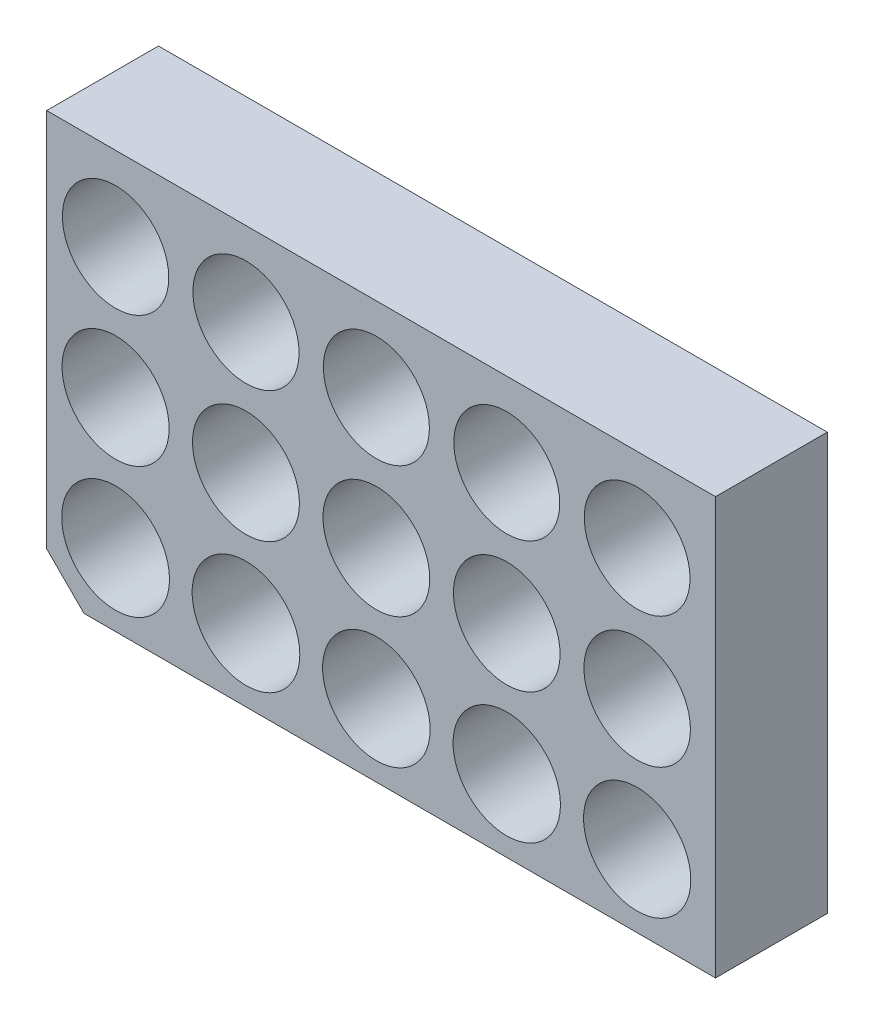
ISO-10303-21;
HEADER;
FILE_DESCRIPTION(('STEP AP214'),'2;1');
FILE_NAME('part.step','',(''),(''),'','','');
FILE_SCHEMA(('AUTOMOTIVE_DESIGN { 1 0 10303 214 1 1 1 1 }'));
ENDSEC;
DATA;
#1=APPLICATION_CONTEXT('core data for automotive mechanical design processes');
#2=APPLICATION_PROTOCOL_DEFINITION('international standard','automotive_design',2000,#1);
#3=PRODUCT_CONTEXT('',#1,'mechanical');
#4=PRODUCT('Part','Part','',(#3));
#5=PRODUCT_RELATED_PRODUCT_CATEGORY('part','',(#4));
#6=PRODUCT_DEFINITION_FORMATION('','',#4);
#7=PRODUCT_DEFINITION_CONTEXT('part definition',#1,'design');
#8=PRODUCT_DEFINITION('design','',#6,#7);
#9=PRODUCT_DEFINITION_SHAPE('','',#8);
#10=(LENGTH_UNIT() NAMED_UNIT(*) SI_UNIT(.MILLI.,.METRE.));
#11=(NAMED_UNIT(*) PLANE_ANGLE_UNIT() SI_UNIT($,.RADIAN.));
#12=(NAMED_UNIT(*) SI_UNIT($,.STERADIAN.) SOLID_ANGLE_UNIT());
#13=UNCERTAINTY_MEASURE_WITH_UNIT(LENGTH_MEASURE(1.E-05),#10,'distance_accuracy_value','');
#14=(GEOMETRIC_REPRESENTATION_CONTEXT(3) GLOBAL_UNCERTAINTY_ASSIGNED_CONTEXT((#13)) GLOBAL_UNIT_ASSIGNED_CONTEXT((#10,
#11,#12)) REPRESENTATION_CONTEXT('',''));
#15=CARTESIAN_POINT('',(0.,0.,0.));
#16=DIRECTION('',(0.,0.,1.));
#17=DIRECTION('',(1.,0.,0.));
#18=AXIS2_PLACEMENT_3D('',#15,#16,#17);
#19=CARTESIAN_POINT('',(0.,0.,7.62));
#20=DIRECTION('',(0.,0.,-1.));
#21=DIRECTION('',(-1.,0.,0.));
#22=AXIS2_PLACEMENT_3D('',#19,#20,#21);
#23=PLANE('',#22);
#24=DIRECTION('',(0.,-1.,0.));
#25=VECTOR('',#24,1.);
#26=CARTESIAN_POINT('',(0.,0.,7.62));
#27=LINE('',#26,#25);
#28=CARTESIAN_POINT('',(0.,28.4186947346982,7.62));
#29=VERTEX_POINT('',#28);
#30=CARTESIAN_POINT('',(0.,2.54000000000001,7.62));
#31=VERTEX_POINT('',#30);
#32=EDGE_CURVE('E97',#29,#31,#27,.T.);
#33=ORIENTED_EDGE('',*,*,#32,.T.);
#34=DIRECTION('',(-0.707106781186546,0.707106781186549,0.));
#35=VECTOR('',#34,1.);
#36=CARTESIAN_POINT('',(2.53999999999999,0.,7.62));
#37=LINE('',#36,#35);
#38=CARTESIAN_POINT('',(2.53999999999999,0.,7.62));
#39=VERTEX_POINT('',#38);
#40=EDGE_CURVE('E11',#31,#39,#37,.F.);
#41=ORIENTED_EDGE('',*,*,#40,.T.);
#42=DIRECTION('',(1.,0.,0.));
#43=VECTOR('',#42,1.);
#44=CARTESIAN_POINT('',(0.,0.,7.62));
#45=LINE('',#44,#43);
#46=CARTESIAN_POINT('',(45.5965586840994,0.,7.62));
#47=VERTEX_POINT('',#46);
#48=EDGE_CURVE('E87',#39,#47,#45,.T.);
#49=ORIENTED_EDGE('',*,*,#48,.T.);
#50=DIRECTION('',(0.,1.,0.));
#51=VECTOR('',#50,1.);
#52=CARTESIAN_POINT('',(45.5965586840994,0.,7.62));
#53=LINE('',#52,#51);
#54=CARTESIAN_POINT('',(45.5965586840994,28.4186947346982,7.62));
#55=VERTEX_POINT('',#54);
#56=EDGE_CURVE('E91',#47,#55,#53,.T.);
#57=ORIENTED_EDGE('',*,*,#56,.T.);
#58=DIRECTION('',(-1.,0.,0.));
#59=VECTOR('',#58,1.);
#60=CARTESIAN_POINT('',(0.,28.4186947346982,7.62));
#61=LINE('',#60,#59);
#62=EDGE_CURVE('E111',#55,#29,#61,.T.);
#63=ORIENTED_EDGE('',*,*,#62,.T.);
#64=EDGE_LOOP('',(#33,#41,#49,#57,#63));
#65=FACE_BOUND('',#64,.T.);
#66=CARTESIAN_POINT('',(4.69472391797769,4.9343876919489,7.62));
#67=DIRECTION('',(0.,0.,1.));
#68=DIRECTION('',(1.,0.,0.));
#69=AXIS2_PLACEMENT_3D('',#66,#67,#68);
#70=CIRCLE('',#69,3.675);
#71=CARTESIAN_POINT('',(8.36972391797769,4.9343876919489,7.62));
#72=VERTEX_POINT('',#71);
#73=EDGE_CURVE('E119',#72,#72,#70,.T.);
#74=ORIENTED_EDGE('',*,*,#73,.F.);
#75=EDGE_LOOP('',(#74));
#76=FACE_BOUND('',#75,.T.);
#77=CARTESIAN_POINT('',(13.5847239179777,4.9343876919489,7.62));
#78=DIRECTION('',(0.,0.,1.));
#79=DIRECTION('',(1.,0.,0.));
#80=AXIS2_PLACEMENT_3D('',#77,#78,#79);
#81=CIRCLE('',#80,3.67);
#82=CARTESIAN_POINT('',(17.2547239179777,4.9343876919489,7.62));
#83=VERTEX_POINT('',#82);
#84=EDGE_CURVE('E348',#83,#83,#81,.T.);
#85=ORIENTED_EDGE('',*,*,#84,.F.);
#86=EDGE_LOOP('',(#85));
#87=FACE_BOUND('',#86,.T.);
#88=CARTESIAN_POINT('',(22.4747239179777,4.9343876919489,7.62));
#89=DIRECTION('',(0.,0.,1.));
#90=DIRECTION('',(1.,0.,0.));
#91=AXIS2_PLACEMENT_3D('',#88,#89,#90);
#92=CIRCLE('',#91,3.665);
#93=CARTESIAN_POINT('',(26.1397239179777,4.9343876919489,7.62));
#94=VERTEX_POINT('',#93);
#95=EDGE_CURVE('E356',#94,#94,#92,.T.);
#96=ORIENTED_EDGE('',*,*,#95,.F.);
#97=EDGE_LOOP('',(#96));
#98=FACE_BOUND('',#97,.T.);
#99=CARTESIAN_POINT('',(31.3647239179777,4.9343876919489,7.62));
#100=DIRECTION('',(0.,0.,1.));
#101=DIRECTION('',(1.,0.,0.));
#102=AXIS2_PLACEMENT_3D('',#99,#100,#101);
#103=CIRCLE('',#102,3.65999999999999);
#104=CARTESIAN_POINT('',(35.0247239179777,4.9343876919489,7.62));
#105=VERTEX_POINT('',#104);
#106=EDGE_CURVE('E361',#105,#105,#103,.T.);
#107=ORIENTED_EDGE('',*,*,#106,.F.);
#108=EDGE_LOOP('',(#107));
#109=FACE_BOUND('',#108,.T.);
#110=CARTESIAN_POINT('',(40.2547239179777,4.9343876919489,7.62));
#111=DIRECTION('',(0.,0.,1.));
#112=DIRECTION('',(1.,0.,0.));
#113=AXIS2_PLACEMENT_3D('',#110,#111,#112);
#114=CIRCLE('',#113,3.655);
#115=CARTESIAN_POINT('',(43.9097239179777,4.9343876919489,7.62));
#116=VERTEX_POINT('',#115);
#117=EDGE_CURVE('E367',#116,#116,#114,.T.);
#118=ORIENTED_EDGE('',*,*,#117,.F.);
#119=EDGE_LOOP('',(#118));
#120=FACE_BOUND('',#119,.T.);
#121=CARTESIAN_POINT('',(13.5847239179777,13.8243876919489,7.62));
#122=DIRECTION('',(0.,0.,1.));
#123=DIRECTION('',(1.,0.,0.));
#124=AXIS2_PLACEMENT_3D('',#121,#122,#123);
#125=CIRCLE('',#124,3.645);
#126=CARTESIAN_POINT('',(17.2297239179777,13.8243876919489,7.62));
#127=VERTEX_POINT('',#126);
#128=EDGE_CURVE('E373',#127,#127,#125,.T.);
#129=ORIENTED_EDGE('',*,*,#128,.F.);
#130=EDGE_LOOP('',(#129));
#131=FACE_BOUND('',#130,.T.);
#132=CARTESIAN_POINT('',(22.4747239179777,13.8243876919489,7.62));
#133=DIRECTION('',(0.,0.,1.));
#134=DIRECTION('',(1.,0.,0.));
#135=AXIS2_PLACEMENT_3D('',#132,#133,#134);
#136=CIRCLE('',#135,3.64);
#137=CARTESIAN_POINT('',(26.1147239179777,13.8243876919489,7.62));
#138=VERTEX_POINT('',#137);
#139=EDGE_CURVE('E379',#138,#138,#136,.T.);
#140=ORIENTED_EDGE('',*,*,#139,.F.);
#141=EDGE_LOOP('',(#140));
#142=FACE_BOUND('',#141,.T.);
#143=CARTESIAN_POINT('',(31.3647239179777,13.8243876919489,7.62));
#144=DIRECTION('',(0.,0.,1.));
#145=DIRECTION('',(1.,0.,0.));
#146=AXIS2_PLACEMENT_3D('',#143,#144,#145);
#147=CIRCLE('',#146,3.635);
#148=CARTESIAN_POINT('',(34.9997239179777,13.8243876919489,7.62));
#149=VERTEX_POINT('',#148);
#150=EDGE_CURVE('E385',#149,#149,#147,.T.);
#151=ORIENTED_EDGE('',*,*,#150,.F.);
#152=EDGE_LOOP('',(#151));
#153=FACE_BOUND('',#152,.T.);
#154=CARTESIAN_POINT('',(40.2547239179777,13.8243876919489,7.62));
#155=DIRECTION('',(0.,0.,1.));
#156=DIRECTION('',(1.,0.,0.));
#157=AXIS2_PLACEMENT_3D('',#154,#155,#156);
#158=CIRCLE('',#157,3.63);
#159=CARTESIAN_POINT('',(43.8847239179777,13.8243876919489,7.62));
#160=VERTEX_POINT('',#159);
#161=EDGE_CURVE('E391',#160,#160,#158,.T.);
#162=ORIENTED_EDGE('',*,*,#161,.F.);
#163=EDGE_LOOP('',(#162));
#164=FACE_BOUND('',#163,.T.);
#165=CARTESIAN_POINT('',(13.5847239179776,22.7143876919489,7.62));
#166=DIRECTION('',(0.,0.,1.));
#167=DIRECTION('',(1.,0.,0.));
#168=AXIS2_PLACEMENT_3D('',#165,#166,#167);
#169=CIRCLE('',#168,3.62);
#170=CARTESIAN_POINT('',(17.2047239179776,22.7143876919489,7.62));
#171=VERTEX_POINT('',#170);
#172=EDGE_CURVE('E397',#171,#171,#169,.T.);
#173=ORIENTED_EDGE('',*,*,#172,.F.);
#174=EDGE_LOOP('',(#173));
#175=FACE_BOUND('',#174,.T.);
#176=CARTESIAN_POINT('',(22.4747239179776,22.7143876919489,7.62));
#177=DIRECTION('',(0.,0.,1.));
#178=DIRECTION('',(1.,0.,0.));
#179=AXIS2_PLACEMENT_3D('',#176,#177,#178);
#180=CIRCLE('',#179,3.615);
#181=CARTESIAN_POINT('',(26.0897239179776,22.7143876919489,7.62));
#182=VERTEX_POINT('',#181);
#183=EDGE_CURVE('E403',#182,#182,#180,.T.);
#184=ORIENTED_EDGE('',*,*,#183,.F.);
#185=EDGE_LOOP('',(#184));
#186=FACE_BOUND('',#185,.T.);
#187=CARTESIAN_POINT('',(31.3647239179776,22.7143876919489,7.62));
#188=DIRECTION('',(0.,0.,1.));
#189=DIRECTION('',(1.,0.,0.));
#190=AXIS2_PLACEMENT_3D('',#187,#188,#189);
#191=CIRCLE('',#190,3.61);
#192=CARTESIAN_POINT('',(34.9747239179776,22.7143876919489,7.62));
#193=VERTEX_POINT('',#192);
#194=EDGE_CURVE('E409',#193,#193,#191,.T.);
#195=ORIENTED_EDGE('',*,*,#194,.F.);
#196=EDGE_LOOP('',(#195));
#197=FACE_BOUND('',#196,.T.);
#198=CARTESIAN_POINT('',(40.2547239179776,22.7143876919489,7.62));
#199=DIRECTION('',(0.,0.,1.));
#200=DIRECTION('',(1.,0.,0.));
#201=AXIS2_PLACEMENT_3D('',#198,#199,#200);
#202=CIRCLE('',#201,3.605);
#203=CARTESIAN_POINT('',(43.8597239179776,22.7143876919489,7.62));
#204=VERTEX_POINT('',#203);
#205=EDGE_CURVE('E415',#204,#204,#202,.T.);
#206=ORIENTED_EDGE('',*,*,#205,.F.);
#207=EDGE_LOOP('',(#206));
#208=FACE_BOUND('',#207,.T.);
#209=CARTESIAN_POINT('',(4.69472391797766,13.8243876919489,7.62));
#210=DIRECTION('',(0.,0.,1.));
#211=DIRECTION('',(1.,0.,0.));
#212=AXIS2_PLACEMENT_3D('',#209,#210,#211);
#213=CIRCLE('',#212,3.65);
#214=CARTESIAN_POINT('',(8.34472391797766,13.8243876919489,7.62));
#215=VERTEX_POINT('',#214);
#216=EDGE_CURVE('E421',#215,#215,#213,.T.);
#217=ORIENTED_EDGE('',*,*,#216,.F.);
#218=EDGE_LOOP('',(#217));
#219=FACE_BOUND('',#218,.T.);
#220=CARTESIAN_POINT('',(4.69472391797763,22.7143876919489,7.62));
#221=DIRECTION('',(0.,0.,1.));
#222=DIRECTION('',(1.,0.,0.));
#223=AXIS2_PLACEMENT_3D('',#220,#221,#222);
#224=CIRCLE('',#223,3.625);
#225=CARTESIAN_POINT('',(8.31972391797763,22.7143876919489,7.62));
#226=VERTEX_POINT('',#225);
#227=EDGE_CURVE('E427',#226,#226,#224,.T.);
#228=ORIENTED_EDGE('',*,*,#227,.F.);
#229=EDGE_LOOP('',(#228));
#230=FACE_BOUND('',#229,.T.);
#231=ADVANCED_FACE('F40',(#65,#76,#87,#98,#109,#120,#131,#142,#153,#164,#175,#186,#197,#208,
#219,#230),#23,.F.);
#232=CARTESIAN_POINT('',(0.,0.,0.));
#233=DIRECTION('',(0.,0.,-1.));
#234=DIRECTION('',(-1.,0.,0.));
#235=AXIS2_PLACEMENT_3D('',#232,#233,#234);
#236=PLANE('',#235);
#237=CARTESIAN_POINT('',(4.69472391797766,13.8243876919489,0.));
#238=DIRECTION('',(0.,0.,1.));
#239=DIRECTION('',(1.,0.,0.));
#240=AXIS2_PLACEMENT_3D('',#237,#238,#239);
#241=CIRCLE('',#240,3.65);
#242=CARTESIAN_POINT('',(8.34472391797766,13.8243876919489,0.));
#243=VERTEX_POINT('',#242);
#244=EDGE_CURVE('E424',#243,#243,#241,.T.);
#245=ORIENTED_EDGE('',*,*,#244,.T.);
#246=EDGE_LOOP('',(#245));
#247=FACE_BOUND('',#246,.T.);
#248=CARTESIAN_POINT('',(31.3647239179776,22.7143876919489,0.));
#249=DIRECTION('',(0.,0.,1.));
#250=DIRECTION('',(1.,0.,0.));
#251=AXIS2_PLACEMENT_3D('',#248,#249,#250);
#252=CIRCLE('',#251,3.61);
#253=CARTESIAN_POINT('',(34.9747239179776,22.7143876919489,0.));
#254=VERTEX_POINT('',#253);
#255=EDGE_CURVE('E412',#254,#254,#252,.T.);
#256=ORIENTED_EDGE('',*,*,#255,.T.);
#257=EDGE_LOOP('',(#256));
#258=FACE_BOUND('',#257,.T.);
#259=CARTESIAN_POINT('',(13.5847239179776,22.7143876919489,0.));
#260=DIRECTION('',(0.,0.,1.));
#261=DIRECTION('',(1.,0.,0.));
#262=AXIS2_PLACEMENT_3D('',#259,#260,#261);
#263=CIRCLE('',#262,3.62);
#264=CARTESIAN_POINT('',(17.2047239179776,22.7143876919489,0.));
#265=VERTEX_POINT('',#264);
#266=EDGE_CURVE('E400',#265,#265,#263,.T.);
#267=ORIENTED_EDGE('',*,*,#266,.T.);
#268=EDGE_LOOP('',(#267));
#269=FACE_BOUND('',#268,.T.);
#270=CARTESIAN_POINT('',(31.3647239179777,13.8243876919489,0.));
#271=DIRECTION('',(0.,0.,1.));
#272=DIRECTION('',(1.,0.,0.));
#273=AXIS2_PLACEMENT_3D('',#270,#271,#272);
#274=CIRCLE('',#273,3.635);
#275=CARTESIAN_POINT('',(34.9997239179777,13.8243876919489,0.));
#276=VERTEX_POINT('',#275);
#277=EDGE_CURVE('E388',#276,#276,#274,.T.);
#278=ORIENTED_EDGE('',*,*,#277,.T.);
#279=EDGE_LOOP('',(#278));
#280=FACE_BOUND('',#279,.T.);
#281=CARTESIAN_POINT('',(13.5847239179777,13.8243876919489,0.));
#282=DIRECTION('',(0.,0.,1.));
#283=DIRECTION('',(1.,0.,0.));
#284=AXIS2_PLACEMENT_3D('',#281,#282,#283);
#285=CIRCLE('',#284,3.645);
#286=CARTESIAN_POINT('',(17.2297239179777,13.8243876919489,0.));
#287=VERTEX_POINT('',#286);
#288=EDGE_CURVE('E376',#287,#287,#285,.T.);
#289=ORIENTED_EDGE('',*,*,#288,.T.);
#290=EDGE_LOOP('',(#289));
#291=FACE_BOUND('',#290,.T.);
#292=CARTESIAN_POINT('',(31.3647239179777,4.9343876919489,0.));
#293=DIRECTION('',(0.,0.,1.));
#294=DIRECTION('',(1.,0.,0.));
#295=AXIS2_PLACEMENT_3D('',#292,#293,#294);
#296=CIRCLE('',#295,3.65999999999999);
#297=CARTESIAN_POINT('',(35.0247239179777,4.9343876919489,0.));
#298=VERTEX_POINT('',#297);
#299=EDGE_CURVE('E364',#298,#298,#296,.T.);
#300=ORIENTED_EDGE('',*,*,#299,.T.);
#301=EDGE_LOOP('',(#300));
#302=FACE_BOUND('',#301,.T.);
#303=CARTESIAN_POINT('',(13.5847239179777,4.9343876919489,0.));
#304=DIRECTION('',(0.,0.,1.));
#305=DIRECTION('',(1.,0.,0.));
#306=AXIS2_PLACEMENT_3D('',#303,#304,#305);
#307=CIRCLE('',#306,3.67);
#308=CARTESIAN_POINT('',(17.2547239179777,4.9343876919489,0.));
#309=VERTEX_POINT('',#308);
#310=EDGE_CURVE('E352',#309,#309,#307,.T.);
#311=ORIENTED_EDGE('',*,*,#310,.T.);
#312=EDGE_LOOP('',(#311));
#313=FACE_BOUND('',#312,.T.);
#314=DIRECTION('',(1.,0.,0.));
#315=VECTOR('',#314,1.);
#316=CARTESIAN_POINT('',(0.,0.,0.));
#317=LINE('',#316,#315);
#318=CARTESIAN_POINT('',(2.53999999999999,0.,0.));
#319=VERTEX_POINT('',#318);
#320=CARTESIAN_POINT('',(45.5965586840994,0.,0.));
#321=VERTEX_POINT('',#320);
#322=EDGE_CURVE('E102',#319,#321,#317,.T.);
#323=ORIENTED_EDGE('',*,*,#322,.F.);
#324=DIRECTION('',(0.707106781186546,-0.707106781186549,0.));
#325=VECTOR('',#324,1.);
#326=CARTESIAN_POINT('',(1.27,1.27,0.));
#327=LINE('',#326,#325);
#328=CARTESIAN_POINT('',(0.,2.54000000000001,0.));
#329=VERTEX_POINT('',#328);
#330=EDGE_CURVE('E63',#319,#329,#327,.F.);
#331=ORIENTED_EDGE('',*,*,#330,.T.);
#332=DIRECTION('',(0.,-1.,0.));
#333=VECTOR('',#332,1.);
#334=CARTESIAN_POINT('',(0.,0.,0.));
#335=LINE('',#334,#333);
#336=CARTESIAN_POINT('',(0.,28.4186947346982,0.));
#337=VERTEX_POINT('',#336);
#338=EDGE_CURVE('E117',#337,#329,#335,.T.);
#339=ORIENTED_EDGE('',*,*,#338,.F.);
#340=DIRECTION('',(-1.,0.,0.));
#341=VECTOR('',#340,1.);
#342=CARTESIAN_POINT('',(0.,28.4186947346982,0.));
#343=LINE('',#342,#341);
#344=CARTESIAN_POINT('',(45.5965586840994,28.4186947346982,0.));
#345=VERTEX_POINT('',#344);
#346=EDGE_CURVE('E123',#345,#337,#343,.T.);
#347=ORIENTED_EDGE('',*,*,#346,.F.);
#348=DIRECTION('',(0.,1.,0.));
#349=VECTOR('',#348,1.);
#350=CARTESIAN_POINT('',(45.5965586840994,0.,0.));
#351=LINE('',#350,#349);
#352=EDGE_CURVE('E121',#321,#345,#351,.T.);
#353=ORIENTED_EDGE('',*,*,#352,.F.);
#354=EDGE_LOOP('',(#323,#331,#339,#347,#353));
#355=FACE_BOUND('',#354,.T.);
#356=CARTESIAN_POINT('',(4.69472391797769,4.9343876919489,0.));
#357=DIRECTION('',(0.,0.,1.));
#358=DIRECTION('',(1.,0.,0.));
#359=AXIS2_PLACEMENT_3D('',#356,#357,#358);
#360=CIRCLE('',#359,3.675);
#361=CARTESIAN_POINT('',(8.36972391797769,4.9343876919489,0.));
#362=VERTEX_POINT('',#361);
#363=EDGE_CURVE('E347',#362,#362,#360,.T.);
#364=ORIENTED_EDGE('',*,*,#363,.T.);
#365=EDGE_LOOP('',(#364));
#366=FACE_BOUND('',#365,.T.);
#367=CARTESIAN_POINT('',(22.4747239179777,4.9343876919489,0.));
#368=DIRECTION('',(0.,0.,1.));
#369=DIRECTION('',(1.,0.,0.));
#370=AXIS2_PLACEMENT_3D('',#367,#368,#369);
#371=CIRCLE('',#370,3.665);
#372=CARTESIAN_POINT('',(26.1397239179777,4.9343876919489,0.));
#373=VERTEX_POINT('',#372);
#374=EDGE_CURVE('E358',#373,#373,#371,.T.);
#375=ORIENTED_EDGE('',*,*,#374,.T.);
#376=EDGE_LOOP('',(#375));
#377=FACE_BOUND('',#376,.T.);
#378=CARTESIAN_POINT('',(40.2547239179777,4.9343876919489,0.));
#379=DIRECTION('',(0.,0.,1.));
#380=DIRECTION('',(1.,0.,0.));
#381=AXIS2_PLACEMENT_3D('',#378,#379,#380);
#382=CIRCLE('',#381,3.655);
#383=CARTESIAN_POINT('',(43.9097239179777,4.9343876919489,0.));
#384=VERTEX_POINT('',#383);
#385=EDGE_CURVE('E370',#384,#384,#382,.T.);
#386=ORIENTED_EDGE('',*,*,#385,.T.);
#387=EDGE_LOOP('',(#386));
#388=FACE_BOUND('',#387,.T.);
#389=CARTESIAN_POINT('',(22.4747239179777,13.8243876919489,0.));
#390=DIRECTION('',(0.,0.,1.));
#391=DIRECTION('',(1.,0.,0.));
#392=AXIS2_PLACEMENT_3D('',#389,#390,#391);
#393=CIRCLE('',#392,3.64);
#394=CARTESIAN_POINT('',(26.1147239179777,13.8243876919489,0.));
#395=VERTEX_POINT('',#394);
#396=EDGE_CURVE('E382',#395,#395,#393,.T.);
#397=ORIENTED_EDGE('',*,*,#396,.T.);
#398=EDGE_LOOP('',(#397));
#399=FACE_BOUND('',#398,.T.);
#400=CARTESIAN_POINT('',(40.2547239179777,13.8243876919489,0.));
#401=DIRECTION('',(0.,0.,1.));
#402=DIRECTION('',(1.,0.,0.));
#403=AXIS2_PLACEMENT_3D('',#400,#401,#402);
#404=CIRCLE('',#403,3.63);
#405=CARTESIAN_POINT('',(43.8847239179777,13.8243876919489,0.));
#406=VERTEX_POINT('',#405);
#407=EDGE_CURVE('E394',#406,#406,#404,.T.);
#408=ORIENTED_EDGE('',*,*,#407,.T.);
#409=EDGE_LOOP('',(#408));
#410=FACE_BOUND('',#409,.T.);
#411=CARTESIAN_POINT('',(22.4747239179776,22.7143876919489,0.));
#412=DIRECTION('',(0.,0.,1.));
#413=DIRECTION('',(1.,0.,0.));
#414=AXIS2_PLACEMENT_3D('',#411,#412,#413);
#415=CIRCLE('',#414,3.615);
#416=CARTESIAN_POINT('',(26.0897239179776,22.7143876919489,0.));
#417=VERTEX_POINT('',#416);
#418=EDGE_CURVE('E406',#417,#417,#415,.T.);
#419=ORIENTED_EDGE('',*,*,#418,.T.);
#420=EDGE_LOOP('',(#419));
#421=FACE_BOUND('',#420,.T.);
#422=CARTESIAN_POINT('',(40.2547239179776,22.7143876919489,0.));
#423=DIRECTION('',(0.,0.,1.));
#424=DIRECTION('',(1.,0.,0.));
#425=AXIS2_PLACEMENT_3D('',#422,#423,#424);
#426=CIRCLE('',#425,3.605);
#427=CARTESIAN_POINT('',(43.8597239179776,22.7143876919489,0.));
#428=VERTEX_POINT('',#427);
#429=EDGE_CURVE('E418',#428,#428,#426,.T.);
#430=ORIENTED_EDGE('',*,*,#429,.T.);
#431=EDGE_LOOP('',(#430));
#432=FACE_BOUND('',#431,.T.);
#433=CARTESIAN_POINT('',(4.69472391797763,22.7143876919489,0.));
#434=DIRECTION('',(0.,0.,1.));
#435=DIRECTION('',(1.,0.,0.));
#436=AXIS2_PLACEMENT_3D('',#433,#434,#435);
#437=CIRCLE('',#436,3.625);
#438=CARTESIAN_POINT('',(8.31972391797763,22.7143876919489,0.));
#439=VERTEX_POINT('',#438);
#440=EDGE_CURVE('E430',#439,#439,#437,.T.);
#441=ORIENTED_EDGE('',*,*,#440,.T.);
#442=EDGE_LOOP('',(#441));
#443=FACE_BOUND('',#442,.T.);
#444=ADVANCED_FACE('F130',(#247,#258,#269,#280,#291,#302,#313,#355,#366,#377,#388,#399,#410,
#421,#432,#443),#236,.T.);
#445=CARTESIAN_POINT('',(0.,0.,7.62));
#446=DIRECTION('',(1.,0.,0.));
#447=DIRECTION('',(0.,0.,-1.));
#448=AXIS2_PLACEMENT_3D('',#445,#446,#447);
#449=PLANE('',#448);
#450=ORIENTED_EDGE('',*,*,#338,.T.);
#451=DIRECTION('',(0.,0.,1.));
#452=VECTOR('',#451,1.);
#453=CARTESIAN_POINT('',(0.,2.54000000000001,7.62));
#454=LINE('',#453,#452);
#455=EDGE_CURVE('E49',#329,#31,#454,.T.);
#456=ORIENTED_EDGE('',*,*,#455,.T.);
#457=ORIENTED_EDGE('',*,*,#32,.F.);
#458=DIRECTION('',(0.,0.,-1.));
#459=VECTOR('',#458,1.);
#460=CARTESIAN_POINT('',(0.,28.4186947346982,7.62));
#461=LINE('',#460,#459);
#462=EDGE_CURVE('E113',#29,#337,#461,.T.);
#463=ORIENTED_EDGE('',*,*,#462,.T.);
#464=EDGE_LOOP('',(#450,#456,#457,#463));
#465=FACE_BOUND('',#464,.T.);
#466=ADVANCED_FACE('F150',(#465),#449,.F.);
#467=CARTESIAN_POINT('',(0.,0.,7.62));
#468=DIRECTION('',(0.,1.,0.));
#469=DIRECTION('',(0.,0.,1.));
#470=AXIS2_PLACEMENT_3D('',#467,#468,#469);
#471=PLANE('',#470);
#472=ORIENTED_EDGE('',*,*,#48,.F.);
#473=DIRECTION('',(0.,0.,-1.));
#474=VECTOR('',#473,1.);
#475=CARTESIAN_POINT('',(2.53999999999999,0.,7.62));
#476=LINE('',#475,#474);
#477=EDGE_CURVE('E105',#39,#319,#476,.T.);
#478=ORIENTED_EDGE('',*,*,#477,.T.);
#479=ORIENTED_EDGE('',*,*,#322,.T.);
#480=DIRECTION('',(0.,0.,-1.));
#481=VECTOR('',#480,1.);
#482=CARTESIAN_POINT('',(45.5965586840994,0.,7.62));
#483=LINE('',#482,#481);
#484=EDGE_CURVE('E100',#47,#321,#483,.T.);
#485=ORIENTED_EDGE('',*,*,#484,.F.);
#486=EDGE_LOOP('',(#472,#478,#479,#485));
#487=FACE_BOUND('',#486,.T.);
#488=ADVANCED_FACE('F101',(#487),#471,.F.);
#489=CARTESIAN_POINT('',(45.5965586840994,0.,7.62));
#490=DIRECTION('',(-1.,0.,0.));
#491=DIRECTION('',(0.,0.,1.));
#492=AXIS2_PLACEMENT_3D('',#489,#490,#491);
#493=PLANE('',#492);
#494=ORIENTED_EDGE('',*,*,#352,.T.);
#495=DIRECTION('',(0.,0.,-1.));
#496=VECTOR('',#495,1.);
#497=CARTESIAN_POINT('',(45.5965586840994,28.4186947346982,7.62));
#498=LINE('',#497,#496);
#499=EDGE_CURVE('E106',#55,#345,#498,.T.);
#500=ORIENTED_EDGE('',*,*,#499,.F.);
#501=ORIENTED_EDGE('',*,*,#56,.F.);
#502=ORIENTED_EDGE('',*,*,#484,.T.);
#503=EDGE_LOOP('',(#494,#500,#501,#502));
#504=FACE_BOUND('',#503,.T.);
#505=ADVANCED_FACE('F108',(#504),#493,.F.);
#506=CARTESIAN_POINT('',(0.,28.4186947346982,7.62));
#507=DIRECTION('',(0.,-1.,0.));
#508=DIRECTION('',(0.,0.,-1.));
#509=AXIS2_PLACEMENT_3D('',#506,#507,#508);
#510=PLANE('',#509);
#511=ORIENTED_EDGE('',*,*,#346,.T.);
#512=ORIENTED_EDGE('',*,*,#462,.F.);
#513=ORIENTED_EDGE('',*,*,#62,.F.);
#514=ORIENTED_EDGE('',*,*,#499,.T.);
#515=EDGE_LOOP('',(#511,#512,#513,#514));
#516=FACE_BOUND('',#515,.T.);
#517=ADVANCED_FACE('F134',(#516),#510,.F.);
#518=CARTESIAN_POINT('',(4.69472391797769,4.9343876919489,7.62));
#519=DIRECTION('',(0.,0.,-1.));
#520=DIRECTION('',(-1.,0.,0.));
#521=AXIS2_PLACEMENT_3D('',#518,#519,#520);
#522=CYLINDRICAL_SURFACE('',#521,3.675);
#523=ORIENTED_EDGE('',*,*,#73,.T.);
#524=EDGE_LOOP('',(#523));
#525=FACE_BOUND('',#524,.T.);
#526=ORIENTED_EDGE('',*,*,#363,.F.);
#527=EDGE_LOOP('',(#526));
#528=FACE_BOUND('',#527,.T.);
#529=ADVANCED_FACE('F154',(#525,#528),#522,.F.);
#530=CARTESIAN_POINT('',(13.5847239179777,4.9343876919489,7.62));
#531=DIRECTION('',(0.,0.,-1.));
#532=DIRECTION('',(-1.,0.,0.));
#533=AXIS2_PLACEMENT_3D('',#530,#531,#532);
#534=CYLINDRICAL_SURFACE('',#533,3.67);
#535=ORIENTED_EDGE('',*,*,#84,.T.);
#536=EDGE_LOOP('',(#535));
#537=FACE_BOUND('',#536,.T.);
#538=ORIENTED_EDGE('',*,*,#310,.F.);
#539=EDGE_LOOP('',(#538));
#540=FACE_BOUND('',#539,.T.);
#541=ADVANCED_FACE('F286',(#537,#540),#534,.F.);
#542=CARTESIAN_POINT('',(22.4747239179777,4.9343876919489,7.62));
#543=DIRECTION('',(0.,0.,-1.));
#544=DIRECTION('',(-1.,0.,0.));
#545=AXIS2_PLACEMENT_3D('',#542,#543,#544);
#546=CYLINDRICAL_SURFACE('',#545,3.665);
#547=ORIENTED_EDGE('',*,*,#95,.T.);
#548=EDGE_LOOP('',(#547));
#549=FACE_BOUND('',#548,.T.);
#550=ORIENTED_EDGE('',*,*,#374,.F.);
#551=EDGE_LOOP('',(#550));
#552=FACE_BOUND('',#551,.T.);
#553=ADVANCED_FACE('F277',(#549,#552),#546,.F.);
#554=CARTESIAN_POINT('',(31.3647239179777,4.9343876919489,7.62));
#555=DIRECTION('',(0.,0.,-1.));
#556=DIRECTION('',(-1.,0.,0.));
#557=AXIS2_PLACEMENT_3D('',#554,#555,#556);
#558=CYLINDRICAL_SURFACE('',#557,3.65999999999999);
#559=ORIENTED_EDGE('',*,*,#106,.T.);
#560=EDGE_LOOP('',(#559));
#561=FACE_BOUND('',#560,.T.);
#562=ORIENTED_EDGE('',*,*,#299,.F.);
#563=EDGE_LOOP('',(#562));
#564=FACE_BOUND('',#563,.T.);
#565=ADVANCED_FACE('F268',(#561,#564),#558,.F.);
#566=CARTESIAN_POINT('',(40.2547239179777,4.9343876919489,7.62));
#567=DIRECTION('',(0.,0.,-1.));
#568=DIRECTION('',(-1.,0.,0.));
#569=AXIS2_PLACEMENT_3D('',#566,#567,#568);
#570=CYLINDRICAL_SURFACE('',#569,3.655);
#571=ORIENTED_EDGE('',*,*,#117,.T.);
#572=EDGE_LOOP('',(#571));
#573=FACE_BOUND('',#572,.T.);
#574=ORIENTED_EDGE('',*,*,#385,.F.);
#575=EDGE_LOOP('',(#574));
#576=FACE_BOUND('',#575,.T.);
#577=ADVANCED_FACE('F259',(#573,#576),#570,.F.);
#578=CARTESIAN_POINT('',(13.5847239179777,13.8243876919489,7.62));
#579=DIRECTION('',(0.,0.,-1.));
#580=DIRECTION('',(-1.,0.,0.));
#581=AXIS2_PLACEMENT_3D('',#578,#579,#580);
#582=CYLINDRICAL_SURFACE('',#581,3.645);
#583=ORIENTED_EDGE('',*,*,#128,.T.);
#584=EDGE_LOOP('',(#583));
#585=FACE_BOUND('',#584,.T.);
#586=ORIENTED_EDGE('',*,*,#288,.F.);
#587=EDGE_LOOP('',(#586));
#588=FACE_BOUND('',#587,.T.);
#589=ADVANCED_FACE('F250',(#585,#588),#582,.F.);
#590=CARTESIAN_POINT('',(22.4747239179777,13.8243876919489,7.62));
#591=DIRECTION('',(0.,0.,-1.));
#592=DIRECTION('',(-1.,0.,0.));
#593=AXIS2_PLACEMENT_3D('',#590,#591,#592);
#594=CYLINDRICAL_SURFACE('',#593,3.64);
#595=ORIENTED_EDGE('',*,*,#139,.T.);
#596=EDGE_LOOP('',(#595));
#597=FACE_BOUND('',#596,.T.);
#598=ORIENTED_EDGE('',*,*,#396,.F.);
#599=EDGE_LOOP('',(#598));
#600=FACE_BOUND('',#599,.T.);
#601=ADVANCED_FACE('F241',(#597,#600),#594,.F.);
#602=CARTESIAN_POINT('',(31.3647239179777,13.8243876919489,7.62));
#603=DIRECTION('',(0.,0.,-1.));
#604=DIRECTION('',(-1.,0.,0.));
#605=AXIS2_PLACEMENT_3D('',#602,#603,#604);
#606=CYLINDRICAL_SURFACE('',#605,3.635);
#607=ORIENTED_EDGE('',*,*,#150,.T.);
#608=EDGE_LOOP('',(#607));
#609=FACE_BOUND('',#608,.T.);
#610=ORIENTED_EDGE('',*,*,#277,.F.);
#611=EDGE_LOOP('',(#610));
#612=FACE_BOUND('',#611,.T.);
#613=ADVANCED_FACE('F232',(#609,#612),#606,.F.);
#614=CARTESIAN_POINT('',(40.2547239179777,13.8243876919489,7.62));
#615=DIRECTION('',(0.,0.,-1.));
#616=DIRECTION('',(-1.,0.,0.));
#617=AXIS2_PLACEMENT_3D('',#614,#615,#616);
#618=CYLINDRICAL_SURFACE('',#617,3.63);
#619=ORIENTED_EDGE('',*,*,#161,.T.);
#620=EDGE_LOOP('',(#619));
#621=FACE_BOUND('',#620,.T.);
#622=ORIENTED_EDGE('',*,*,#407,.F.);
#623=EDGE_LOOP('',(#622));
#624=FACE_BOUND('',#623,.T.);
#625=ADVANCED_FACE('F223',(#621,#624),#618,.F.);
#626=CARTESIAN_POINT('',(13.5847239179776,22.7143876919489,7.62));
#627=DIRECTION('',(0.,0.,-1.));
#628=DIRECTION('',(-1.,0.,0.));
#629=AXIS2_PLACEMENT_3D('',#626,#627,#628);
#630=CYLINDRICAL_SURFACE('',#629,3.62);
#631=ORIENTED_EDGE('',*,*,#172,.T.);
#632=EDGE_LOOP('',(#631));
#633=FACE_BOUND('',#632,.T.);
#634=ORIENTED_EDGE('',*,*,#266,.F.);
#635=EDGE_LOOP('',(#634));
#636=FACE_BOUND('',#635,.T.);
#637=ADVANCED_FACE('F214',(#633,#636),#630,.F.);
#638=CARTESIAN_POINT('',(22.4747239179776,22.7143876919489,7.62));
#639=DIRECTION('',(0.,0.,-1.));
#640=DIRECTION('',(-1.,0.,0.));
#641=AXIS2_PLACEMENT_3D('',#638,#639,#640);
#642=CYLINDRICAL_SURFACE('',#641,3.615);
#643=ORIENTED_EDGE('',*,*,#183,.T.);
#644=EDGE_LOOP('',(#643));
#645=FACE_BOUND('',#644,.T.);
#646=ORIENTED_EDGE('',*,*,#418,.F.);
#647=EDGE_LOOP('',(#646));
#648=FACE_BOUND('',#647,.T.);
#649=ADVANCED_FACE('F205',(#645,#648),#642,.F.);
#650=CARTESIAN_POINT('',(31.3647239179776,22.7143876919489,7.62));
#651=DIRECTION('',(0.,0.,-1.));
#652=DIRECTION('',(-1.,0.,0.));
#653=AXIS2_PLACEMENT_3D('',#650,#651,#652);
#654=CYLINDRICAL_SURFACE('',#653,3.61);
#655=ORIENTED_EDGE('',*,*,#194,.T.);
#656=EDGE_LOOP('',(#655));
#657=FACE_BOUND('',#656,.T.);
#658=ORIENTED_EDGE('',*,*,#255,.F.);
#659=EDGE_LOOP('',(#658));
#660=FACE_BOUND('',#659,.T.);
#661=ADVANCED_FACE('F196',(#657,#660),#654,.F.);
#662=CARTESIAN_POINT('',(40.2547239179776,22.7143876919489,7.62));
#663=DIRECTION('',(0.,0.,-1.));
#664=DIRECTION('',(-1.,0.,0.));
#665=AXIS2_PLACEMENT_3D('',#662,#663,#664);
#666=CYLINDRICAL_SURFACE('',#665,3.605);
#667=ORIENTED_EDGE('',*,*,#205,.T.);
#668=EDGE_LOOP('',(#667));
#669=FACE_BOUND('',#668,.T.);
#670=ORIENTED_EDGE('',*,*,#429,.F.);
#671=EDGE_LOOP('',(#670));
#672=FACE_BOUND('',#671,.T.);
#673=ADVANCED_FACE('F187',(#669,#672),#666,.F.);
#674=CARTESIAN_POINT('',(4.69472391797766,13.8243876919489,7.62));
#675=DIRECTION('',(0.,0.,-1.));
#676=DIRECTION('',(-1.,0.,0.));
#677=AXIS2_PLACEMENT_3D('',#674,#675,#676);
#678=CYLINDRICAL_SURFACE('',#677,3.65);
#679=ORIENTED_EDGE('',*,*,#216,.T.);
#680=EDGE_LOOP('',(#679));
#681=FACE_BOUND('',#680,.T.);
#682=ORIENTED_EDGE('',*,*,#244,.F.);
#683=EDGE_LOOP('',(#682));
#684=FACE_BOUND('',#683,.T.);
#685=ADVANCED_FACE('F141',(#681,#684),#678,.F.);
#686=CARTESIAN_POINT('',(4.69472391797763,22.7143876919489,7.62));
#687=DIRECTION('',(0.,0.,-1.));
#688=DIRECTION('',(-1.,0.,0.));
#689=AXIS2_PLACEMENT_3D('',#686,#687,#688);
#690=CYLINDRICAL_SURFACE('',#689,3.625);
#691=ORIENTED_EDGE('',*,*,#227,.T.);
#692=EDGE_LOOP('',(#691));
#693=FACE_BOUND('',#692,.T.);
#694=ORIENTED_EDGE('',*,*,#440,.F.);
#695=EDGE_LOOP('',(#694));
#696=FACE_BOUND('',#695,.T.);
#697=ADVANCED_FACE('F137',(#693,#696),#690,.F.);
#698=CARTESIAN_POINT('',(2.53999999999999,0.,7.62));
#699=DIRECTION('',(0.707106781186549,0.707106781186546,0.));
#700=DIRECTION('',(0.,0.,-1.));
#701=AXIS2_PLACEMENT_3D('',#698,#699,#700);
#702=PLANE('',#701);
#703=ORIENTED_EDGE('',*,*,#40,.F.);
#704=ORIENTED_EDGE('',*,*,#455,.F.);
#705=ORIENTED_EDGE('',*,*,#330,.F.);
#706=ORIENTED_EDGE('',*,*,#477,.F.);
#707=EDGE_LOOP('',(#703,#704,#705,#706));
#708=FACE_BOUND('',#707,.T.);
#709=ADVANCED_FACE('F43',(#708),#702,.F.);
#710=CLOSED_SHELL('',(#231,#444,#466,#488,#505,#517,#529,#541,#553,#565,#577,#589,#601,#613,
#625,#637,#649,#661,#673,#685,#697,#709));
#711=MANIFOLD_SOLID_BREP('B2',#710);
#712=ADVANCED_BREP_SHAPE_REPRESENTATION('',(#18,#711),#14);
#713=SHAPE_DEFINITION_REPRESENTATION(#9,#712);
ENDSEC;
END-ISO-10303-21;
